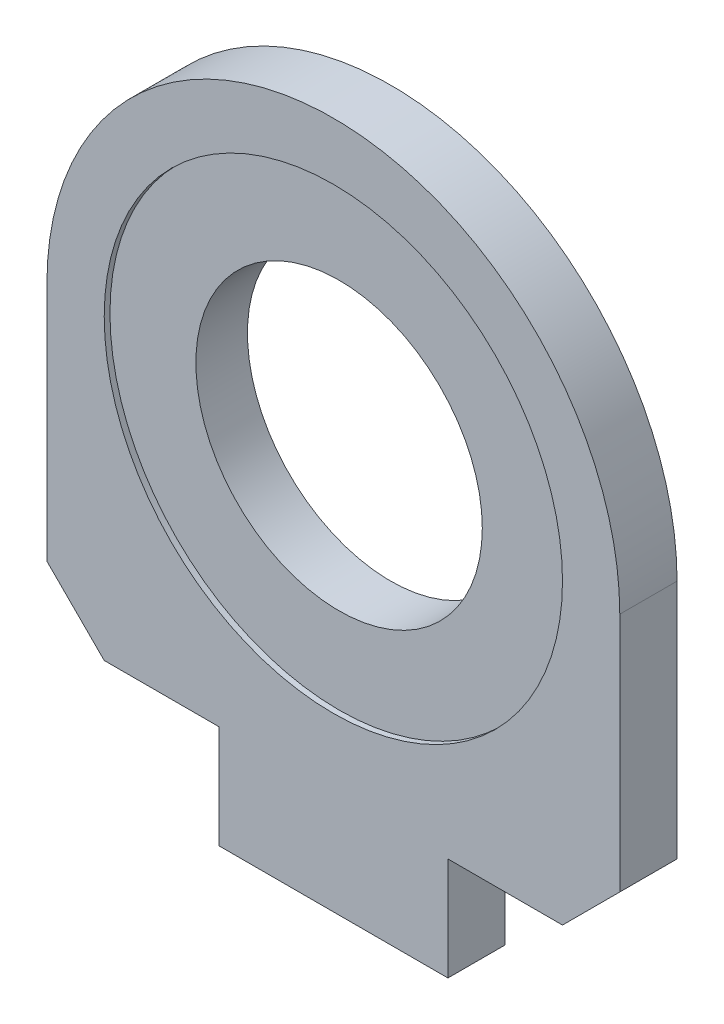
ISO-10303-21;
HEADER;
FILE_DESCRIPTION(('STEP AP214'),'2;1');
FILE_NAME('part.step','',(''),(''),'','','');
FILE_SCHEMA(('AUTOMOTIVE_DESIGN { 1 0 10303 214 1 1 1 1 }'));
ENDSEC;
DATA;
#1=APPLICATION_CONTEXT('core data for automotive mechanical design processes');
#2=APPLICATION_PROTOCOL_DEFINITION('international standard','automotive_design',2000,#1);
#3=PRODUCT_CONTEXT('',#1,'mechanical');
#4=PRODUCT('Part','Part','',(#3));
#5=PRODUCT_RELATED_PRODUCT_CATEGORY('part','',(#4));
#6=PRODUCT_DEFINITION_FORMATION('','',#4);
#7=PRODUCT_DEFINITION_CONTEXT('part definition',#1,'design');
#8=PRODUCT_DEFINITION('design','',#6,#7);
#9=PRODUCT_DEFINITION_SHAPE('','',#8);
#10=(LENGTH_UNIT() NAMED_UNIT(*) SI_UNIT(.MILLI.,.METRE.));
#11=(NAMED_UNIT(*) PLANE_ANGLE_UNIT() SI_UNIT($,.RADIAN.));
#12=(NAMED_UNIT(*) SI_UNIT($,.STERADIAN.) SOLID_ANGLE_UNIT());
#13=UNCERTAINTY_MEASURE_WITH_UNIT(LENGTH_MEASURE(1.E-05),#10,'distance_accuracy_value','');
#14=(GEOMETRIC_REPRESENTATION_CONTEXT(3) GLOBAL_UNCERTAINTY_ASSIGNED_CONTEXT((#13)) GLOBAL_UNIT_ASSIGNED_CONTEXT((#10,
#11,#12)) REPRESENTATION_CONTEXT('',''));
#15=CARTESIAN_POINT('',(0.,0.,0.));
#16=DIRECTION('',(0.,0.,1.));
#17=DIRECTION('',(1.,0.,0.));
#18=AXIS2_PLACEMENT_3D('',#15,#16,#17);
#19=CARTESIAN_POINT('',(0.,0.,10.));
#20=DIRECTION('',(0.,0.,-1.));
#21=DIRECTION('',(-1.,0.,0.));
#22=AXIS2_PLACEMENT_3D('',#19,#20,#21);
#23=CYLINDRICAL_SURFACE('',#22,25.);
#24=CARTESIAN_POINT('',(0.,0.,0.));
#25=DIRECTION('',(0.,0.,1.));
#26=DIRECTION('',(1.,0.,0.));
#27=AXIS2_PLACEMENT_3D('',#24,#25,#26);
#28=CIRCLE('',#27,25.);
#29=CARTESIAN_POINT('',(25.,0.,0.));
#30=VERTEX_POINT('',#29);
#31=EDGE_CURVE('E143',#30,#30,#28,.T.);
#32=ORIENTED_EDGE('',*,*,#31,.F.);
#33=EDGE_LOOP('',(#32));
#34=FACE_BOUND('',#33,.T.);
#35=CARTESIAN_POINT('',(0.,0.,9.));
#36=DIRECTION('',(0.,0.,1.));
#37=DIRECTION('',(1.,0.,0.));
#38=AXIS2_PLACEMENT_3D('',#35,#36,#37);
#39=CIRCLE('',#38,25.);
#40=CARTESIAN_POINT('',(25.,0.,9.));
#41=VERTEX_POINT('',#40);
#42=EDGE_CURVE('E224',#41,#41,#39,.T.);
#43=ORIENTED_EDGE('',*,*,#42,.T.);
#44=EDGE_LOOP('',(#43));
#45=FACE_BOUND('',#44,.T.);
#46=ADVANCED_FACE('F39',(#34,#45),#23,.F.);
#47=CARTESIAN_POINT('',(50.,0.,10.));
#48=DIRECTION('',(1.,0.,0.));
#49=DIRECTION('',(0.,1.,0.));
#50=AXIS2_PLACEMENT_3D('',#47,#48,#49);
#51=PLANE('',#50);
#52=DIRECTION('',(0.,-1.,0.));
#53=VECTOR('',#52,1.);
#54=CARTESIAN_POINT('',(50.,0.,0.));
#55=LINE('',#54,#53);
#56=CARTESIAN_POINT('',(50.,0.,0.));
#57=VERTEX_POINT('',#56);
#58=CARTESIAN_POINT('',(50.,-42.,0.));
#59=VERTEX_POINT('',#58);
#60=EDGE_CURVE('E146',#57,#59,#55,.T.);
#61=ORIENTED_EDGE('',*,*,#60,.F.);
#62=DIRECTION('',(0.,0.,-1.));
#63=VECTOR('',#62,1.);
#64=CARTESIAN_POINT('',(50.,0.,10.));
#65=LINE('',#64,#63);
#66=CARTESIAN_POINT('',(50.,0.,10.));
#67=VERTEX_POINT('',#66);
#68=EDGE_CURVE('E12',#67,#57,#65,.T.);
#69=ORIENTED_EDGE('',*,*,#68,.F.);
#70=DIRECTION('',(0.,-1.,0.));
#71=VECTOR('',#70,1.);
#72=CARTESIAN_POINT('',(50.,0.,10.));
#73=LINE('',#72,#71);
#74=CARTESIAN_POINT('',(50.,-42.,10.));
#75=VERTEX_POINT('',#74);
#76=EDGE_CURVE('E173',#67,#75,#73,.T.);
#77=ORIENTED_EDGE('',*,*,#76,.T.);
#78=DIRECTION('',(0.,0.,-1.));
#79=VECTOR('',#78,1.);
#80=CARTESIAN_POINT('',(50.,-42.,10.));
#81=LINE('',#80,#79);
#82=EDGE_CURVE('E55',#75,#59,#81,.T.);
#83=ORIENTED_EDGE('',*,*,#82,.T.);
#84=EDGE_LOOP('',(#61,#69,#77,#83));
#85=FACE_BOUND('',#84,.T.);
#86=ADVANCED_FACE('F203',(#85),#51,.T.);
#87=CARTESIAN_POINT('',(0.,0.,10.));
#88=DIRECTION('',(0.,0.,-1.));
#89=DIRECTION('',(-1.,0.,0.));
#90=AXIS2_PLACEMENT_3D('',#87,#88,#89);
#91=CYLINDRICAL_SURFACE('',#90,50.);
#92=CARTESIAN_POINT('',(0.,0.,0.));
#93=DIRECTION('',(0.,0.,1.));
#94=DIRECTION('',(1.,0.,0.));
#95=AXIS2_PLACEMENT_3D('',#92,#93,#94);
#96=CIRCLE('',#95,50.);
#97=CARTESIAN_POINT('',(-50.,0.,0.));
#98=VERTEX_POINT('',#97);
#99=EDGE_CURVE('E149',#98,#57,#96,.F.);
#100=ORIENTED_EDGE('',*,*,#99,.F.);
#101=DIRECTION('',(0.,0.,-1.));
#102=VECTOR('',#101,1.);
#103=CARTESIAN_POINT('',(-50.,0.,10.));
#104=LINE('',#103,#102);
#105=CARTESIAN_POINT('',(-50.,0.,10.));
#106=VERTEX_POINT('',#105);
#107=EDGE_CURVE('E47',#106,#98,#104,.T.);
#108=ORIENTED_EDGE('',*,*,#107,.F.);
#109=CARTESIAN_POINT('',(0.,0.,10.));
#110=DIRECTION('',(0.,0.,1.));
#111=DIRECTION('',(1.,0.,0.));
#112=AXIS2_PLACEMENT_3D('',#109,#110,#111);
#113=CIRCLE('',#112,50.);
#114=EDGE_CURVE('E202',#106,#67,#113,.F.);
#115=ORIENTED_EDGE('',*,*,#114,.T.);
#116=ORIENTED_EDGE('',*,*,#68,.T.);
#117=EDGE_LOOP('',(#100,#108,#115,#116));
#118=FACE_BOUND('',#117,.T.);
#119=ADVANCED_FACE('F201',(#118),#91,.T.);
#120=CARTESIAN_POINT('',(-50.,0.,10.));
#121=DIRECTION('',(1.,0.,0.));
#122=DIRECTION('',(0.,1.,0.));
#123=AXIS2_PLACEMENT_3D('',#120,#121,#122);
#124=PLANE('',#123);
#125=DIRECTION('',(0.,-1.,0.));
#126=VECTOR('',#125,1.);
#127=CARTESIAN_POINT('',(-50.,0.,0.));
#128=LINE('',#127,#126);
#129=CARTESIAN_POINT('',(-50.,-42.,0.));
#130=VERTEX_POINT('',#129);
#131=EDGE_CURVE('E152',#98,#130,#128,.T.);
#132=ORIENTED_EDGE('',*,*,#131,.T.);
#133=DIRECTION('',(0.,0.,-1.));
#134=VECTOR('',#133,1.);
#135=CARTESIAN_POINT('',(-50.,-42.,10.));
#136=LINE('',#135,#134);
#137=CARTESIAN_POINT('',(-50.,-42.,10.));
#138=VERTEX_POINT('',#137);
#139=EDGE_CURVE('E186',#138,#130,#136,.T.);
#140=ORIENTED_EDGE('',*,*,#139,.F.);
#141=DIRECTION('',(0.,-1.,0.));
#142=VECTOR('',#141,1.);
#143=CARTESIAN_POINT('',(-50.,0.,10.));
#144=LINE('',#143,#142);
#145=EDGE_CURVE('E194',#106,#138,#144,.T.);
#146=ORIENTED_EDGE('',*,*,#145,.F.);
#147=ORIENTED_EDGE('',*,*,#107,.T.);
#148=EDGE_LOOP('',(#132,#140,#146,#147));
#149=FACE_BOUND('',#148,.T.);
#150=ADVANCED_FACE('F191',(#149),#124,.F.);
#151=CARTESIAN_POINT('',(-46.0000000000001,-45.9999999999999,10.));
#152=DIRECTION('',(0.707106781186549,0.707106781186546,0.));
#153=DIRECTION('',(-0.707106781186546,0.707106781186549,0.));
#154=AXIS2_PLACEMENT_3D('',#151,#152,#153);
#155=PLANE('',#154);
#156=DIRECTION('',(0.707106781186546,-0.707106781186549,0.));
#157=VECTOR('',#156,1.);
#158=CARTESIAN_POINT('',(-46.0000000000001,-45.9999999999999,0.));
#159=LINE('',#158,#157);
#160=CARTESIAN_POINT('',(-40.,-52.,0.));
#161=VERTEX_POINT('',#160);
#162=EDGE_CURVE('E155',#130,#161,#159,.T.);
#163=ORIENTED_EDGE('',*,*,#162,.T.);
#164=DIRECTION('',(0.,0.,-1.));
#165=VECTOR('',#164,1.);
#166=CARTESIAN_POINT('',(-40.,-52.,10.));
#167=LINE('',#166,#165);
#168=CARTESIAN_POINT('',(-40.,-52.,10.));
#169=VERTEX_POINT('',#168);
#170=EDGE_CURVE('E183',#169,#161,#167,.T.);
#171=ORIENTED_EDGE('',*,*,#170,.F.);
#172=DIRECTION('',(0.707106781186546,-0.707106781186549,0.));
#173=VECTOR('',#172,1.);
#174=CARTESIAN_POINT('',(-46.0000000000001,-45.9999999999999,10.));
#175=LINE('',#174,#173);
#176=EDGE_CURVE('E236',#138,#169,#175,.T.);
#177=ORIENTED_EDGE('',*,*,#176,.F.);
#178=ORIENTED_EDGE('',*,*,#139,.T.);
#179=EDGE_LOOP('',(#163,#171,#177,#178));
#180=FACE_BOUND('',#179,.T.);
#181=ADVANCED_FACE('F253',(#180),#155,.F.);
#182=CARTESIAN_POINT('',(0.,-52.,10.));
#183=DIRECTION('',(0.,1.,0.));
#184=DIRECTION('',(0.,0.,1.));
#185=AXIS2_PLACEMENT_3D('',#182,#183,#184);
#186=PLANE('',#185);
#187=DIRECTION('',(1.,0.,0.));
#188=VECTOR('',#187,1.);
#189=CARTESIAN_POINT('',(0.,-52.,0.));
#190=LINE('',#189,#188);
#191=CARTESIAN_POINT('',(-20.,-52.,0.));
#192=VERTEX_POINT('',#191);
#193=EDGE_CURVE('E158',#161,#192,#190,.T.);
#194=ORIENTED_EDGE('',*,*,#193,.T.);
#195=DIRECTION('',(0.,0.,-1.));
#196=VECTOR('',#195,1.);
#197=CARTESIAN_POINT('',(-20.,-52.,10.));
#198=LINE('',#197,#196);
#199=CARTESIAN_POINT('',(-20.,-52.,10.));
#200=VERTEX_POINT('',#199);
#201=EDGE_CURVE('E180',#200,#192,#198,.T.);
#202=ORIENTED_EDGE('',*,*,#201,.F.);
#203=DIRECTION('',(1.,0.,0.));
#204=VECTOR('',#203,1.);
#205=CARTESIAN_POINT('',(0.,-52.,10.));
#206=LINE('',#205,#204);
#207=EDGE_CURVE('E239',#169,#200,#206,.T.);
#208=ORIENTED_EDGE('',*,*,#207,.F.);
#209=ORIENTED_EDGE('',*,*,#170,.T.);
#210=EDGE_LOOP('',(#194,#202,#208,#209));
#211=FACE_BOUND('',#210,.T.);
#212=ADVANCED_FACE('F250',(#211),#186,.F.);
#213=CARTESIAN_POINT('',(-20.0000000000001,0.,10.));
#214=DIRECTION('',(1.,0.,0.));
#215=DIRECTION('',(0.,1.,0.));
#216=AXIS2_PLACEMENT_3D('',#213,#214,#215);
#217=PLANE('',#216);
#218=DIRECTION('',(0.,-1.,0.));
#219=VECTOR('',#218,1.);
#220=CARTESIAN_POINT('',(-20.0000000000001,0.,0.));
#221=LINE('',#220,#219);
#222=CARTESIAN_POINT('',(-20.,-70.,0.));
#223=VERTEX_POINT('',#222);
#224=EDGE_CURVE('E161',#192,#223,#221,.T.);
#225=ORIENTED_EDGE('',*,*,#224,.T.);
#226=DIRECTION('',(0.,0.,-1.));
#227=VECTOR('',#226,1.);
#228=CARTESIAN_POINT('',(-20.,-70.,10.));
#229=LINE('',#228,#227);
#230=CARTESIAN_POINT('',(-20.,-70.,10.));
#231=VERTEX_POINT('',#230);
#232=EDGE_CURVE('E177',#231,#223,#229,.T.);
#233=ORIENTED_EDGE('',*,*,#232,.F.);
#234=DIRECTION('',(0.,-1.,0.));
#235=VECTOR('',#234,1.);
#236=CARTESIAN_POINT('',(-20.0000000000001,0.,10.));
#237=LINE('',#236,#235);
#238=EDGE_CURVE('E242',#200,#231,#237,.T.);
#239=ORIENTED_EDGE('',*,*,#238,.F.);
#240=ORIENTED_EDGE('',*,*,#201,.T.);
#241=EDGE_LOOP('',(#225,#233,#239,#240));
#242=FACE_BOUND('',#241,.T.);
#243=ADVANCED_FACE('F246',(#242),#217,.F.);
#244=CARTESIAN_POINT('',(0.,-70.,10.));
#245=DIRECTION('',(0.,1.,0.));
#246=DIRECTION('',(0.,0.,1.));
#247=AXIS2_PLACEMENT_3D('',#244,#245,#246);
#248=PLANE('',#247);
#249=DIRECTION('',(1.,0.,0.));
#250=VECTOR('',#249,1.);
#251=CARTESIAN_POINT('',(0.,-70.,0.));
#252=LINE('',#251,#250);
#253=CARTESIAN_POINT('',(20.,-70.,0.));
#254=VERTEX_POINT('',#253);
#255=EDGE_CURVE('E164',#223,#254,#252,.T.);
#256=ORIENTED_EDGE('',*,*,#255,.T.);
#257=DIRECTION('',(0.,0.,-1.));
#258=VECTOR('',#257,1.);
#259=CARTESIAN_POINT('',(20.,-70.,10.));
#260=LINE('',#259,#258);
#261=CARTESIAN_POINT('',(20.,-70.,10.));
#262=VERTEX_POINT('',#261);
#263=EDGE_CURVE('E126',#262,#254,#260,.T.);
#264=ORIENTED_EDGE('',*,*,#263,.F.);
#265=DIRECTION('',(1.,0.,0.));
#266=VECTOR('',#265,1.);
#267=CARTESIAN_POINT('',(0.,-70.,10.));
#268=LINE('',#267,#266);
#269=EDGE_CURVE('E134',#231,#262,#268,.T.);
#270=ORIENTED_EDGE('',*,*,#269,.F.);
#271=ORIENTED_EDGE('',*,*,#232,.T.);
#272=EDGE_LOOP('',(#256,#264,#270,#271));
#273=FACE_BOUND('',#272,.T.);
#274=ADVANCED_FACE('F248',(#273),#248,.F.);
#275=CARTESIAN_POINT('',(20.,0.,10.));
#276=DIRECTION('',(1.,0.,0.));
#277=DIRECTION('',(0.,1.,0.));
#278=AXIS2_PLACEMENT_3D('',#275,#276,#277);
#279=PLANE('',#278);
#280=DIRECTION('',(0.,-1.,0.));
#281=VECTOR('',#280,1.);
#282=CARTESIAN_POINT('',(20.,0.,0.));
#283=LINE('',#282,#281);
#284=CARTESIAN_POINT('',(20.,-52.,0.));
#285=VERTEX_POINT('',#284);
#286=EDGE_CURVE('E122',#285,#254,#283,.T.);
#287=ORIENTED_EDGE('',*,*,#286,.F.);
#288=DIRECTION('',(0.,0.,-1.));
#289=VECTOR('',#288,1.);
#290=CARTESIAN_POINT('',(20.,-52.,10.));
#291=LINE('',#290,#289);
#292=CARTESIAN_POINT('',(20.,-52.,10.));
#293=VERTEX_POINT('',#292);
#294=EDGE_CURVE('E117',#293,#285,#291,.T.);
#295=ORIENTED_EDGE('',*,*,#294,.F.);
#296=DIRECTION('',(0.,-1.,0.));
#297=VECTOR('',#296,1.);
#298=CARTESIAN_POINT('',(20.,0.,10.));
#299=LINE('',#298,#297);
#300=EDGE_CURVE('E120',#293,#262,#299,.T.);
#301=ORIENTED_EDGE('',*,*,#300,.T.);
#302=ORIENTED_EDGE('',*,*,#263,.T.);
#303=EDGE_LOOP('',(#287,#295,#301,#302));
#304=FACE_BOUND('',#303,.T.);
#305=ADVANCED_FACE('F119',(#304),#279,.T.);
#306=CARTESIAN_POINT('',(0.,-52.,10.));
#307=DIRECTION('',(0.,-1.,0.));
#308=DIRECTION('',(1.,0.,0.));
#309=AXIS2_PLACEMENT_3D('',#306,#307,#308);
#310=PLANE('',#309);
#311=DIRECTION('',(-1.,0.,0.));
#312=VECTOR('',#311,1.);
#313=CARTESIAN_POINT('',(0.,-52.,0.));
#314=LINE('',#313,#312);
#315=CARTESIAN_POINT('',(40.,-52.,0.));
#316=VERTEX_POINT('',#315);
#317=EDGE_CURVE('E168',#316,#285,#314,.T.);
#318=ORIENTED_EDGE('',*,*,#317,.F.);
#319=DIRECTION('',(0.,0.,-1.));
#320=VECTOR('',#319,1.);
#321=CARTESIAN_POINT('',(40.,-52.,10.));
#322=LINE('',#321,#320);
#323=CARTESIAN_POINT('',(40.,-52.,10.));
#324=VERTEX_POINT('',#323);
#325=EDGE_CURVE('E86',#324,#316,#322,.T.);
#326=ORIENTED_EDGE('',*,*,#325,.F.);
#327=DIRECTION('',(-1.,0.,0.));
#328=VECTOR('',#327,1.);
#329=CARTESIAN_POINT('',(0.,-52.,10.));
#330=LINE('',#329,#328);
#331=EDGE_CURVE('E132',#324,#293,#330,.T.);
#332=ORIENTED_EDGE('',*,*,#331,.T.);
#333=ORIENTED_EDGE('',*,*,#294,.T.);
#334=EDGE_LOOP('',(#318,#326,#332,#333));
#335=FACE_BOUND('',#334,.T.);
#336=ADVANCED_FACE('F137',(#335),#310,.T.);
#337=CARTESIAN_POINT('',(46.0000000000001,-45.9999999999999,10.));
#338=DIRECTION('',(0.707106781186549,-0.707106781186546,0.));
#339=DIRECTION('',(0.707106781186546,0.707106781186549,0.));
#340=AXIS2_PLACEMENT_3D('',#337,#338,#339);
#341=PLANE('',#340);
#342=DIRECTION('',(-0.707106781186546,-0.707106781186549,0.));
#343=VECTOR('',#342,1.);
#344=CARTESIAN_POINT('',(46.0000000000001,-45.9999999999999,0.));
#345=LINE('',#344,#343);
#346=EDGE_CURVE('E170',#59,#316,#345,.T.);
#347=ORIENTED_EDGE('',*,*,#346,.F.);
#348=ORIENTED_EDGE('',*,*,#82,.F.);
#349=DIRECTION('',(-0.707106781186546,-0.707106781186549,0.));
#350=VECTOR('',#349,1.);
#351=CARTESIAN_POINT('',(46.0000000000001,-45.9999999999999,10.));
#352=LINE('',#351,#350);
#353=EDGE_CURVE('E138',#75,#324,#352,.T.);
#354=ORIENTED_EDGE('',*,*,#353,.T.);
#355=ORIENTED_EDGE('',*,*,#325,.T.);
#356=EDGE_LOOP('',(#347,#348,#354,#355));
#357=FACE_BOUND('',#356,.T.);
#358=ADVANCED_FACE('F204',(#357),#341,.T.);
#359=CARTESIAN_POINT('',(0.,0.,10.));
#360=DIRECTION('',(0.,0.,1.));
#361=DIRECTION('',(1.,0.,0.));
#362=AXIS2_PLACEMENT_3D('',#359,#360,#361);
#363=PLANE('',#362);
#364=CARTESIAN_POINT('',(0.,0.,10.));
#365=DIRECTION('',(0.,0.,1.));
#366=DIRECTION('',(1.,0.,0.));
#367=AXIS2_PLACEMENT_3D('',#364,#365,#366);
#368=CIRCLE('',#367,40.);
#369=CARTESIAN_POINT('',(40.,0.,10.));
#370=VERTEX_POINT('',#369);
#371=EDGE_CURVE('E226',#370,#370,#368,.T.);
#372=ORIENTED_EDGE('',*,*,#371,.F.);
#373=EDGE_LOOP('',(#372));
#374=FACE_BOUND('',#373,.T.);
#375=ORIENTED_EDGE('',*,*,#76,.F.);
#376=ORIENTED_EDGE('',*,*,#114,.F.);
#377=ORIENTED_EDGE('',*,*,#145,.T.);
#378=ORIENTED_EDGE('',*,*,#176,.T.);
#379=ORIENTED_EDGE('',*,*,#207,.T.);
#380=ORIENTED_EDGE('',*,*,#238,.T.);
#381=ORIENTED_EDGE('',*,*,#269,.T.);
#382=ORIENTED_EDGE('',*,*,#300,.F.);
#383=ORIENTED_EDGE('',*,*,#331,.F.);
#384=ORIENTED_EDGE('',*,*,#353,.F.);
#385=EDGE_LOOP('',(#375,#376,#377,#378,#379,#380,#381,#382,#383,#384));
#386=FACE_BOUND('',#385,.T.);
#387=ADVANCED_FACE('F130',(#374,#386),#363,.T.);
#388=CARTESIAN_POINT('',(0.,0.,0.));
#389=DIRECTION('',(0.,0.,1.));
#390=DIRECTION('',(1.,0.,0.));
#391=AXIS2_PLACEMENT_3D('',#388,#389,#390);
#392=PLANE('',#391);
#393=ORIENTED_EDGE('',*,*,#31,.T.);
#394=EDGE_LOOP('',(#393));
#395=FACE_BOUND('',#394,.T.);
#396=ORIENTED_EDGE('',*,*,#60,.T.);
#397=ORIENTED_EDGE('',*,*,#346,.T.);
#398=ORIENTED_EDGE('',*,*,#317,.T.);
#399=ORIENTED_EDGE('',*,*,#286,.T.);
#400=ORIENTED_EDGE('',*,*,#255,.F.);
#401=ORIENTED_EDGE('',*,*,#224,.F.);
#402=ORIENTED_EDGE('',*,*,#193,.F.);
#403=ORIENTED_EDGE('',*,*,#162,.F.);
#404=ORIENTED_EDGE('',*,*,#131,.F.);
#405=ORIENTED_EDGE('',*,*,#99,.T.);
#406=EDGE_LOOP('',(#396,#397,#398,#399,#400,#401,#402,#403,#404,#405));
#407=FACE_BOUND('',#406,.T.);
#408=ADVANCED_FACE('F200',(#395,#407),#392,.F.);
#409=CARTESIAN_POINT('',(0.,0.,9.));
#410=DIRECTION('',(0.,0.,1.));
#411=DIRECTION('',(1.,0.,0.));
#412=AXIS2_PLACEMENT_3D('',#409,#410,#411);
#413=CYLINDRICAL_SURFACE('',#412,40.);
#414=CARTESIAN_POINT('',(0.,0.,9.));
#415=DIRECTION('',(0.,0.,1.));
#416=DIRECTION('',(1.,0.,0.));
#417=AXIS2_PLACEMENT_3D('',#414,#415,#416);
#418=CIRCLE('',#417,40.);
#419=CARTESIAN_POINT('',(40.,0.,9.));
#420=VERTEX_POINT('',#419);
#421=EDGE_CURVE('E147',#420,#420,#418,.T.);
#422=ORIENTED_EDGE('',*,*,#421,.F.);
#423=EDGE_LOOP('',(#422));
#424=FACE_BOUND('',#423,.T.);
#425=ORIENTED_EDGE('',*,*,#371,.T.);
#426=EDGE_LOOP('',(#425));
#427=FACE_BOUND('',#426,.T.);
#428=ADVANCED_FACE('F325',(#424,#427),#413,.F.);
#429=CARTESIAN_POINT('',(0.,0.,9.));
#430=DIRECTION('',(0.,0.,1.));
#431=DIRECTION('',(1.,0.,0.));
#432=AXIS2_PLACEMENT_3D('',#429,#430,#431);
#433=PLANE('',#432);
#434=ORIENTED_EDGE('',*,*,#42,.F.);
#435=EDGE_LOOP('',(#434));
#436=FACE_BOUND('',#435,.T.);
#437=ORIENTED_EDGE('',*,*,#421,.T.);
#438=EDGE_LOOP('',(#437));
#439=FACE_BOUND('',#438,.T.);
#440=ADVANCED_FACE('F348',(#436,#439),#433,.T.);
#441=CLOSED_SHELL('',(#46,#86,#119,#150,#181,#212,#243,#274,#305,#336,#358,#387,#408,#428,#440));
#442=MANIFOLD_SOLID_BREP('B2',#441);
#443=ADVANCED_BREP_SHAPE_REPRESENTATION('',(#18,#442),#14);
#444=SHAPE_DEFINITION_REPRESENTATION(#9,#443);
ENDSEC;
END-ISO-10303-21;
